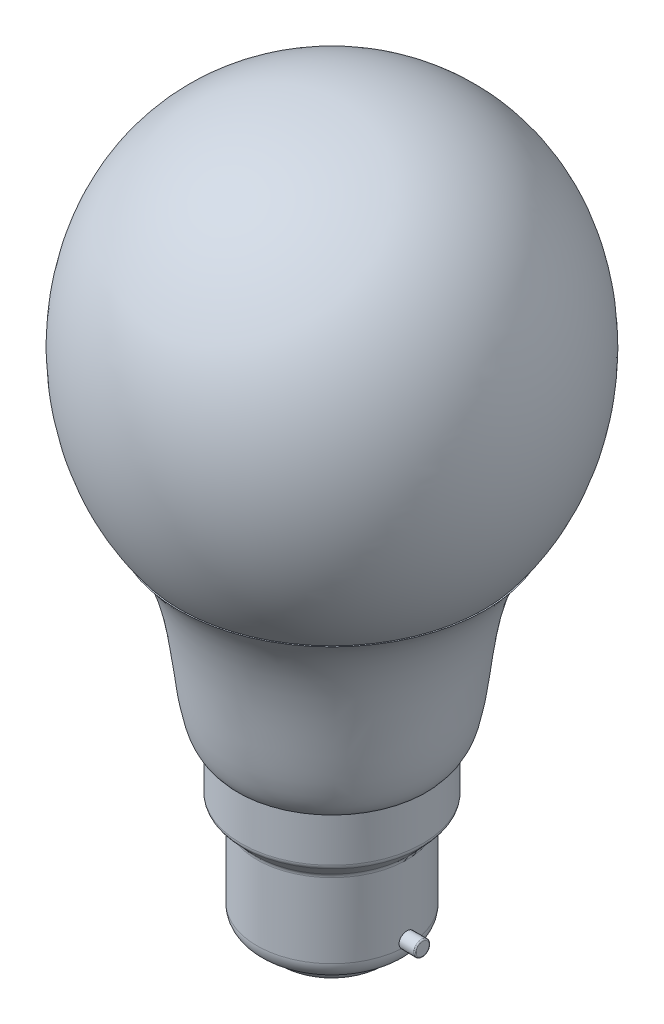
ISO-10303-21;
HEADER;
FILE_DESCRIPTION(('STEP AP214'),'2;1');
FILE_NAME('part.step','',(''),(''),'','','');
FILE_SCHEMA(('AUTOMOTIVE_DESIGN { 1 0 10303 214 1 1 1 1 }'));
ENDSEC;
DATA;
#1=APPLICATION_CONTEXT('core data for automotive mechanical design processes');
#2=APPLICATION_PROTOCOL_DEFINITION('international standard','automotive_design',2000,#1);
#3=PRODUCT_CONTEXT('',#1,'mechanical');
#4=PRODUCT('Part','Part','',(#3));
#5=PRODUCT_RELATED_PRODUCT_CATEGORY('part','',(#4));
#6=PRODUCT_DEFINITION_FORMATION('','',#4);
#7=PRODUCT_DEFINITION_CONTEXT('part definition',#1,'design');
#8=PRODUCT_DEFINITION('design','',#6,#7);
#9=PRODUCT_DEFINITION_SHAPE('','',#8);
#10=(LENGTH_UNIT() NAMED_UNIT(*) SI_UNIT(.MILLI.,.METRE.));
#11=(NAMED_UNIT(*) PLANE_ANGLE_UNIT() SI_UNIT($,.RADIAN.));
#12=(NAMED_UNIT(*) SI_UNIT($,.STERADIAN.) SOLID_ANGLE_UNIT());
#13=UNCERTAINTY_MEASURE_WITH_UNIT(LENGTH_MEASURE(1.E-05),#10,'distance_accuracy_value','');
#14=(GEOMETRIC_REPRESENTATION_CONTEXT(3) GLOBAL_UNCERTAINTY_ASSIGNED_CONTEXT((#13)) GLOBAL_UNIT_ASSIGNED_CONTEXT((#10,
#11,#12)) REPRESENTATION_CONTEXT('',''));
#15=CARTESIAN_POINT('',(0.,0.,0.));
#16=DIRECTION('',(0.,0.,1.));
#17=DIRECTION('',(1.,0.,0.));
#18=AXIS2_PLACEMENT_3D('',#15,#16,#17);
#19=CARTESIAN_POINT('',(0.,30.,0.));
#20=DIRECTION('',(0.,-1.,0.));
#21=DIRECTION('',(0.,0.,-1.));
#22=AXIS2_PLACEMENT_3D('',#19,#20,#21);
#23=PLANE('',#22);
#24=CARTESIAN_POINT('',(0.,30.,0.));
#25=DIRECTION('',(0.,-1.,0.));
#26=DIRECTION('',(0.,0.,-1.));
#27=AXIS2_PLACEMENT_3D('',#24,#25,#26);
#28=CIRCLE('',#27,14.5);
#29=CARTESIAN_POINT('',(0.,30.,-14.5));
#30=VERTEX_POINT('',#29);
#31=EDGE_CURVE('E156',#30,#30,#28,.T.);
#32=ORIENTED_EDGE('',*,*,#31,.F.);
#33=EDGE_LOOP('',(#32));
#34=FACE_BOUND('',#33,.T.);
#35=CARTESIAN_POINT('',(0.,30.,0.));
#36=DIRECTION('',(0.,-1.,0.));
#37=DIRECTION('',(0.,0.,-1.));
#38=AXIS2_PLACEMENT_3D('',#35,#36,#37);
#39=CIRCLE('',#38,15.);
#40=CARTESIAN_POINT('',(0.,30.,-15.));
#41=VERTEX_POINT('',#40);
#42=EDGE_CURVE('E193',#41,#41,#39,.T.);
#43=ORIENTED_EDGE('',*,*,#42,.T.);
#44=EDGE_LOOP('',(#43));
#45=FACE_BOUND('',#44,.T.);
#46=ADVANCED_FACE('F33',(#34,#45),#23,.T.);
#47=CARTESIAN_POINT('',(15.,30.,0.));
#48=CARTESIAN_POINT('',(19.4,34.3,0.));
#49=CARTESIAN_POINT('',(16.4,51.5,0.));
#50=CARTESIAN_POINT('',(24.5114891802732,60.,0.));
#51=B_SPLINE_CURVE_WITH_KNOTS('',3,(#47,#48,#49,#50),.UNSPECIFIED.,.F.,.F.,(4,4),(0.,1.),.UNSPECIFIED.);
#52=CARTESIAN_POINT('',(0.,30.,0.));
#53=DIRECTION('',(0.,-1.,0.));
#54=AXIS1_PLACEMENT('',#52,#53);
#55=SURFACE_OF_REVOLUTION('',#51,#54);
#56=CARTESIAN_POINT('',(0.,60.,0.));
#57=DIRECTION('',(0.,-1.,0.));
#58=DIRECTION('',(0.,0.,-1.));
#59=AXIS2_PLACEMENT_3D('',#56,#57,#58);
#60=CIRCLE('',#59,24.5114891802732);
#61=CARTESIAN_POINT('',(0.,60.,-24.5114891802732));
#62=VERTEX_POINT('',#61);
#63=EDGE_CURVE('E187',#62,#62,#60,.T.);
#64=ORIENTED_EDGE('',*,*,#63,.T.);
#65=EDGE_LOOP('',(#64));
#66=FACE_BOUND('',#65,.T.);
#67=ORIENTED_EDGE('',*,*,#42,.F.);
#68=EDGE_LOOP('',(#67));
#69=FACE_BOUND('',#68,.T.);
#70=ADVANCED_FACE('F79',(#66,#69),#55,.F.);
#71=CARTESIAN_POINT('',(0.,60.,0.));
#72=DIRECTION('',(0.,1.,0.));
#73=DIRECTION('',(0.,0.,1.));
#74=AXIS2_PLACEMENT_3D('',#71,#72,#73);
#75=PLANE('',#74);
#76=CARTESIAN_POINT('',(0.,60.,0.));
#77=DIRECTION('',(0.,-1.,0.));
#78=DIRECTION('',(0.,0.,-1.));
#79=AXIS2_PLACEMENT_3D('',#76,#77,#78);
#80=CIRCLE('',#79,24.3);
#81=CARTESIAN_POINT('',(0.,60.,-24.3));
#82=VERTEX_POINT('',#81);
#83=EDGE_CURVE('E136',#82,#82,#80,.F.);
#84=ORIENTED_EDGE('',*,*,#83,.F.);
#85=EDGE_LOOP('',(#84));
#86=FACE_BOUND('',#85,.T.);
#87=ORIENTED_EDGE('',*,*,#63,.F.);
#88=EDGE_LOOP('',(#87));
#89=FACE_BOUND('',#88,.T.);
#90=ADVANCED_FACE('F85',(#86,#89),#75,.T.);
#91=CARTESIAN_POINT('',(24.3,60.,0.));
#92=CARTESIAN_POINT('',(40.,80.,0.));
#93=CARTESIAN_POINT('',(32.9620865456957,118.,0.));
#94=CARTESIAN_POINT('',(0.,118.,0.));
#95=B_SPLINE_CURVE_WITH_KNOTS('',3,(#91,#92,#93,#94),.UNSPECIFIED.,.F.,.F.,(4,4),(0.,1.),.UNSPECIFIED.);
#96=CARTESIAN_POINT('',(0.,60.,0.));
#97=DIRECTION('',(0.,-1.,0.));
#98=AXIS1_PLACEMENT('',#96,#97);
#99=SURFACE_OF_REVOLUTION('',#95,#98);
#100=CARTESIAN_POINT('',(0.,118.,0.));
#101=VERTEX_POINT('',#100);
#102=VERTEX_LOOP('',#101);
#103=FACE_BOUND('',#102,.T.);
#104=ORIENTED_EDGE('',*,*,#83,.T.);
#105=EDGE_LOOP('',(#104));
#106=FACE_BOUND('',#105,.T.);
#107=ADVANCED_FACE('F170',(#103,#106),#99,.F.);
#108=CARTESIAN_POINT('',(0.,2.,0.));
#109=DIRECTION('',(0.,-1.,0.));
#110=DIRECTION('',(0.,0.,-1.));
#111=AXIS2_PLACEMENT_3D('',#108,#109,#110);
#112=PLANE('',#111);
#113=CARTESIAN_POINT('',(0.,2.,0.));
#114=DIRECTION('',(0.,-1.,0.));
#115=DIRECTION('',(0.,0.,-1.));
#116=AXIS2_PLACEMENT_3D('',#113,#114,#115);
#117=CIRCLE('',#116,6.49242598201266);
#118=CARTESIAN_POINT('',(0.,2.,-6.49242598201266));
#119=VERTEX_POINT('',#118);
#120=EDGE_CURVE('E178',#119,#119,#117,.T.);
#121=ORIENTED_EDGE('',*,*,#120,.T.);
#122=EDGE_LOOP('',(#121));
#123=FACE_BOUND('',#122,.T.);
#124=ADVANCED_FACE('F166',(#123),#112,.T.);
#125=CARTESIAN_POINT('',(0.,4.51694075123591,0.));
#126=DIRECTION('',(0.,-1.,0.));
#127=DIRECTION('',(0.,0.,-1.));
#128=AXIS2_PLACEMENT_3D('',#125,#126,#127);
#129=TOROIDAL_SURFACE('',#128,6.49242598201266,2.51694075123591);
#130=CARTESIAN_POINT('',(0.,4.3,0.));
#131=DIRECTION('',(0.,-1.,0.));
#132=DIRECTION('',(0.,0.,-1.));
#133=AXIS2_PLACEMENT_3D('',#130,#131,#132);
#134=CIRCLE('',#133,9.);
#135=CARTESIAN_POINT('',(0.,4.3,-9.));
#136=VERTEX_POINT('',#135);
#137=EDGE_CURVE('E298',#136,#136,#134,.T.);
#138=ORIENTED_EDGE('',*,*,#137,.T.);
#139=EDGE_LOOP('',(#138));
#140=FACE_BOUND('',#139,.T.);
#141=ORIENTED_EDGE('',*,*,#120,.F.);
#142=EDGE_LOOP('',(#141));
#143=FACE_BOUND('',#142,.T.);
#144=ADVANCED_FACE('F162',(#140,#143),#129,.T.);
#145=CARTESIAN_POINT('',(0.,7.3,0.));
#146=DIRECTION('',(0.,-1.,0.));
#147=DIRECTION('',(0.,0.,-1.));
#148=AXIS2_PLACEMENT_3D('',#145,#146,#147);
#149=TOROIDAL_SURFACE('',#148,9.,3.);
#150=CARTESIAN_POINT('',(11.9689033795343,7.3002,0.863337553551168));
#151=CARTESIAN_POINT('',(11.9706341575066,7.27607125218969,0.839365159570842));
#152=CARTESIAN_POINT('',(11.9720735902,7.25295200182946,0.814380650331551));
#153=CARTESIAN_POINT('',(11.9744692386034,7.20888051311498,0.762552432061032));
#154=CARTESIAN_POINT('',(11.9754255196976,7.18792798184726,0.735708975157763));
#155=CARTESIAN_POINT('',(11.9777164082379,7.1286096995019,0.65273474999263));
#156=CARTESIAN_POINT('',(11.9784789890905,7.09368871092575,0.594066023966319));
#157=CARTESIAN_POINT('',(11.9792180369641,7.03414364574626,0.471741360034935));
#158=CARTESIAN_POINT('',(11.9791943714852,7.00952130539983,0.408084583336799));
#159=CARTESIAN_POINT('',(11.9789561699297,6.97123680559395,0.27755436466876));
#160=CARTESIAN_POINT('',(11.9787416491964,6.95757376526647,0.210681181679771));
#161=CARTESIAN_POINT('',(11.97847561374,6.94154133729614,0.075187146385878));
#162=CARTESIAN_POINT('',(11.978425087023,6.93924035893504,0.00655820268459246));
#163=CARTESIAN_POINT('',(11.9785524448508,6.94618160624795,-0.130128550708673));
#164=CARTESIAN_POINT('',(11.9787303755318,6.95542616349561,-0.198186242244085));
#165=CARTESIAN_POINT('',(11.9790676505371,6.98521598791006,-0.331852418085821));
#166=CARTESIAN_POINT('',(11.9792269749238,7.00577324489496,-0.397458224830683));
#167=CARTESIAN_POINT('',(11.9790057883068,7.05762116610196,-0.524261020037802));
#168=CARTESIAN_POINT('',(11.9786256078853,7.08890524854254,-0.585460684231456));
#169=CARTESIAN_POINT('',(11.976928580572,7.14992301828015,-0.683453304115163));
#170=CARTESIAN_POINT('',(11.9759424700414,7.17707228876608,-0.7218861704971));
#171=CARTESIAN_POINT('',(11.9731223829882,7.23557556513093,-0.795303232034518));
#172=CARTESIAN_POINT('',(11.9712893139324,7.26692504526631,-0.830291069786458));
#173=CARTESIAN_POINT('',(11.9689033795343,7.3002,-0.863337553551168));
#174=B_SPLINE_CURVE_WITH_KNOTS('',3,(#150,#151,#152,#153,#154,#155,#156,#157,#158,#159,#160,
#161,#162,#163,#164,#165,#166,#167,#168,#169,#170,#171,#172,#173),.UNSPECIFIED.,.F.,.F.,(4,2,2,
2,2,2,2,2,2,2,2,4),(0.,0.102105118600656,0.204196415765371,0.407983583896708,0.611805094826217,
0.815610221693627,1.02064094520526,1.22571308052813,1.4310029822916,1.63616714671136,
1.77706011405941,1.91780247157556),.UNSPECIFIED.);
#175=CARTESIAN_POINT('',(11.9689177210223,7.3,0.863138799613092));
#176=VERTEX_POINT('',#175);
#177=CARTESIAN_POINT('',(11.9689177210223,7.3,-0.863138799613093));
#178=VERTEX_POINT('',#177);
#179=EDGE_CURVE('E47',#176,#178,#174,.T.);
#180=ORIENTED_EDGE('',*,*,#179,.F.);
#181=CARTESIAN_POINT('',(0.,7.3,0.));
#182=DIRECTION('',(0.,-1.,0.));
#183=DIRECTION('',(0.,0.,-1.));
#184=AXIS2_PLACEMENT_3D('',#181,#182,#183);
#185=CIRCLE('',#184,12.);
#186=EDGE_CURVE('E297',#176,#178,#185,.T.);
#187=ORIENTED_EDGE('',*,*,#186,.T.);
#188=EDGE_LOOP('',(#180,#187));
#189=FACE_BOUND('',#188,.T.);
#190=ORIENTED_EDGE('',*,*,#137,.F.);
#191=EDGE_LOOP('',(#190));
#192=FACE_BOUND('',#191,.T.);
#193=ADVANCED_FACE('F158',(#189,#192),#149,.T.);
#194=CARTESIAN_POINT('',(0.,0.,0.));
#195=DIRECTION('',(0.,-1.,0.));
#196=DIRECTION('',(0.,0.,-1.));
#197=AXIS2_PLACEMENT_3D('',#194,#195,#196);
#198=CYLINDRICAL_SURFACE('',#197,12.);
#199=CARTESIAN_POINT('',(0.,19.2081304405621,0.));
#200=DIRECTION('',(0.,-1.,0.));
#201=DIRECTION('',(0.,0.,-1.));
#202=AXIS2_PLACEMENT_3D('',#199,#200,#201);
#203=CIRCLE('',#202,12.);
#204=CARTESIAN_POINT('',(0.,19.2081304405621,-12.));
#205=VERTEX_POINT('',#204);
#206=EDGE_CURVE('E11',#205,#205,#203,.T.);
#207=ORIENTED_EDGE('',*,*,#206,.T.);
#208=EDGE_LOOP('',(#207));
#209=FACE_BOUND('',#208,.T.);
#210=CARTESIAN_POINT('',(-11.9733551378516,7.69189243579318,-0.799228842624485));
#211=CARTESIAN_POINT('',(-11.9709108230631,7.73666810789764,-0.835848884443715));
#212=CARTESIAN_POINT('',(-11.9685481032181,7.78456413680672,-0.868720530776431));
#213=CARTESIAN_POINT('',(-11.9642533708202,7.88524242608688,-0.925997730739436));
#214=CARTESIAN_POINT('',(-11.962321833415,7.93802998702529,-0.950393961061867));
#215=CARTESIAN_POINT('',(-11.9591107736815,8.04695699090246,-0.98998281236346));
#216=CARTESIAN_POINT('',(-11.9578310537633,8.10309541230044,-1.0051782227133));
#217=CARTESIAN_POINT('',(-11.9560686173062,8.21712387089126,-1.02593047018923));
#218=CARTESIAN_POINT('',(-11.9555857077967,8.27501348052391,-1.03148964102556));
#219=CARTESIAN_POINT('',(-11.9554710895022,8.39077686496366,-1.03281722486822));
#220=CARTESIAN_POINT('',(-11.9558374943731,8.44865038988828,-1.02860733513095));
#221=CARTESIAN_POINT('',(-11.9573757629071,8.56286852751051,-1.01056693883353));
#222=CARTESIAN_POINT('',(-11.9585476578237,8.61921308079498,-0.996736058973174));
#223=CARTESIAN_POINT('',(-11.9615646154583,8.72879526019824,-0.959849955528018));
#224=CARTESIAN_POINT('',(-11.96340987362,8.78203197905867,-0.936792053611473));
#225=CARTESIAN_POINT('',(-11.9675656879094,8.88388828429431,-0.882111098437407));
#226=CARTESIAN_POINT('',(-11.9698762545422,8.9325077663907,-0.850487851796428));
#227=CARTESIAN_POINT('',(-11.9747128719196,9.02394151515018,-0.779435935863841));
#228=CARTESIAN_POINT('',(-11.9772396880771,9.06673364458091,-0.739978828844984));
#229=CARTESIAN_POINT('',(-11.9822174419855,9.14509656331413,-0.65444364469117));
#230=CARTESIAN_POINT('',(-11.9846683789416,9.18066727698859,-0.608365498224399));
#231=CARTESIAN_POINT('',(-11.9892232157937,9.24363608131418,-0.510795704651895));
#232=CARTESIAN_POINT('',(-11.9913264993498,9.27101972549838,-0.459294702600627));
#233=CARTESIAN_POINT('',(-11.9949434420432,9.31674247139613,-0.352403701698354));
#234=CARTESIAN_POINT('',(-11.9964571117379,9.33508173505446,-0.297013772501093));
#235=CARTESIAN_POINT('',(-11.9987205559673,9.36214534212873,-0.184077412893536));
#236=CARTESIAN_POINT('',(-11.9994724032275,9.37089577962616,-0.126537277903318));
#237=CARTESIAN_POINT('',(-12.0001346430191,9.37861493570346,-0.0108003564379514));
#238=CARTESIAN_POINT('',(-12.0000450530593,9.37758385782017,0.0473964163485029));
#239=CARTESIAN_POINT('',(-11.9990361315213,9.36578873802275,0.162609106576523));
#240=CARTESIAN_POINT('',(-11.9981193047442,9.35505407753285,0.219628057589615));
#241=CARTESIAN_POINT('',(-11.9955621891034,9.32420456302085,0.331051860513969));
#242=CARTESIAN_POINT('',(-11.9939218939766,9.30408962779138,0.385456689789632));
#243=CARTESIAN_POINT('',(-11.9900987328255,9.25502568115005,0.490188549715384));
#244=CARTESIAN_POINT('',(-11.9879151776153,9.2260654377734,0.540510292146107));
#245=CARTESIAN_POINT('',(-11.9832505547734,9.16014182403095,0.63559065249325));
#246=CARTESIAN_POINT('',(-11.9807694798268,9.12317825687357,0.680349133573532));
#247=CARTESIAN_POINT('',(-11.9757777666082,9.04213850459045,0.763203456582288));
#248=CARTESIAN_POINT('',(-11.9732670536227,8.99803693335125,0.801274467833302));
#249=CARTESIAN_POINT('',(-11.9685078247718,8.90405882552769,0.869478558602368));
#250=CARTESIAN_POINT('',(-11.9662593098827,8.8541822674414,0.899611608563779));
#251=CARTESIAN_POINT('',(-11.9622779238526,8.75003459517343,0.951092543112573));
#252=CARTESIAN_POINT('',(-11.9605452985523,8.69576140144957,0.972436241091804));
#253=CARTESIAN_POINT('',(-11.9577945945913,8.58438265356671,1.00569842600469));
#254=CARTESIAN_POINT('',(-11.9567764988745,8.52727716705017,1.01761713791627));
#255=CARTESIAN_POINT('',(-11.9555735907893,8.41206813952015,1.03165424079175));
#256=CARTESIAN_POINT('',(-11.9553858803753,8.3539687811346,1.03380671660731));
#257=CARTESIAN_POINT('',(-11.9558574762483,8.23823586958342,1.02833807617188));
#258=CARTESIAN_POINT('',(-11.9565167700656,8.18060230957282,1.02071710380685));
#259=CARTESIAN_POINT('',(-11.9586050638856,8.06757642532193,0.995950364294392));
#260=CARTESIAN_POINT('',(-11.9600322619454,8.01217917926053,0.978826892507268));
#261=CARTESIAN_POINT('',(-11.9634941277343,7.9050464548704,0.935562066575413));
#262=CARTESIAN_POINT('',(-11.9655288030395,7.85331102221979,0.909420599962458));
#263=CARTESIAN_POINT('',(-11.9699815260405,7.75485275519328,0.84880159181355));
#264=CARTESIAN_POINT('',(-11.9724003423501,7.70814029222029,0.814307263142071));
#265=CARTESIAN_POINT('',(-11.9773468002796,7.62115541959239,0.737985172762881));
#266=CARTESIAN_POINT('',(-11.9798744441977,7.58088314602567,0.696157256127635));
#267=CARTESIAN_POINT('',(-11.9847630505136,7.50779486111379,0.606205881223111));
#268=CARTESIAN_POINT('',(-11.9871234833273,7.47500186837951,0.558063687229684));
#269=CARTESIAN_POINT('',(-11.9914036589495,7.41795737751412,0.456941774893329));
#270=CARTESIAN_POINT('',(-11.9933234026107,7.39370586285729,0.403962065910093));
#271=CARTESIAN_POINT('',(-11.9965055600129,7.35444309966543,0.294684014889312));
#272=CARTESIAN_POINT('',(-11.99776819989,7.33942867194762,0.238386821968091));
#273=CARTESIAN_POINT('',(-11.999494792776,7.31906013051169,0.124061603660808));
#274=CARTESIAN_POINT('',(-11.9999587884693,7.31370550051393,0.0660336709447561));
#275=CARTESIAN_POINT('',(-12.0000358198284,7.31281083038298,-0.0499456798267145));
#276=CARTESIAN_POINT('',(-11.9996510780819,7.31724515594436,-0.107896901026093));
#277=CARTESIAN_POINT('',(-11.9980781419346,7.33575134099819,-0.222242892644024));
#278=CARTESIAN_POINT('',(-11.9968897633901,7.34982540933181,-0.278637303254862));
#279=CARTESIAN_POINT('',(-11.9938425983611,7.38720938213335,-0.388266549394694));
#280=CARTESIAN_POINT('',(-11.9919836508668,7.41052150487664,-0.44150062251919));
#281=CARTESIAN_POINT('',(-11.9878047756708,7.46570650277211,-0.543256721100166));
#282=CARTESIAN_POINT('',(-11.9854853549679,7.49756997601248,-0.591783842385759));
#283=CARTESIAN_POINT('',(-11.981481623089,7.55660792318307,-0.667078800789132));
#284=CARTESIAN_POINT('',(-11.9798540669978,7.58161115724293,-0.695580092952655));
#285=CARTESIAN_POINT('',(-11.9765910592589,7.63459447256391,-0.749666223396765));
#286=CARTESIAN_POINT('',(-11.9749556075846,7.66257456384172,-0.775251051863274));
#287=CARTESIAN_POINT('',(-11.9733551378516,7.69189243579318,-0.799228842624485));
#288=B_SPLINE_CURVE_WITH_KNOTS('',3,(#210,#211,#212,#213,#214,#215,#216,#217,#218,#219,#220,
#221,#222,#223,#224,#225,#226,#227,#228,#229,#230,#231,#232,#233,#234,#235,#236,#237,#238,#239,
#240,#241,#242,#243,#244,#245,#246,#247,#248,#249,#250,#251,#252,#253,#254,#255,#256,#257,#258,
#259,#260,#261,#262,#263,#264,#265,#266,#267,#268,#269,#270,#271,#272,#273,#274,#275,#276,#277,
#278,#279,#280,#281,#282,#283,#284,#285,#286,#287),.UNSPECIFIED.,.T.,.F.,(4,2,2,2,2,2,2,2,2,2,2,
2,2,2,2,2,2,2,2,2,2,2,2,2,2,2,2,2,2,2,2,2,2,2,2,2,2,2,4),(0.,0.173548361190424,
0.347287032696687,0.52097300623491,0.694616910520178,0.867875517865803,1.04114084812466,
1.21445650871124,1.38777608264601,1.56173672349945,1.73569918610398,1.90996682608862,
2.08423134559868,2.25802045209352,2.43180594233813,2.60506698459966,2.77832952685296,
2.95181300285595,3.1253007450819,3.29941962617513,3.47353915558303,3.64774152720637,
3.82193974042862,3.99552951960315,4.16911674319586,4.34229839707861,4.51548221088023,
4.68901701187496,4.86255547936409,5.03662103943651,5.21068626273156,5.38469154340566,
5.55868752388021,5.73222840229671,5.90580905900836,6.07943142182248,6.25286366943766,
6.36649795498896,6.48013262291525),.UNSPECIFIED.);
#289=CARTESIAN_POINT('',(-11.9733551378516,7.69189243579318,-0.799228842624485));
#290=VERTEX_POINT('',#289);
#291=EDGE_CURVE('E137',#290,#290,#288,.T.);
#292=ORIENTED_EDGE('',*,*,#291,.T.);
#293=EDGE_LOOP('',(#292));
#294=FACE_BOUND('',#293,.T.);
#295=ORIENTED_EDGE('',*,*,#186,.F.);
#296=CARTESIAN_POINT('',(11.9689320591518,7.29980000000002,0.862939953536141));
#297=CARTESIAN_POINT('',(11.9671899873021,7.32409729530885,0.887102137699313));
#298=CARTESIAN_POINT('',(11.96544915302,7.34940229179361,0.910227791730076));
#299=CARTESIAN_POINT('',(11.9620173309225,7.40186932200755,0.954268832358208));
#300=CARTESIAN_POINT('',(11.9603263414872,7.42903129529193,0.975184290841334));
#301=CARTESIAN_POINT('',(11.955403615493,7.51298925905739,1.03435660777627));
#302=CARTESIAN_POINT('',(11.9523169834587,7.57232615330209,1.06910775578077));
#303=CARTESIAN_POINT('',(11.9468872794788,7.69602222354421,1.12817138117047));
#304=CARTESIAN_POINT('',(11.9445446198357,7.76038415984394,1.15247807296297));
#305=CARTESIAN_POINT('',(11.940870701843,7.89229401152683,1.18994266412983));
#306=CARTESIAN_POINT('',(11.9395391626414,7.95984103666901,1.20310365948524));
#307=CARTESIAN_POINT('',(11.9380424735856,8.09597648297196,1.21786622816644));
#308=CARTESIAN_POINT('',(11.9378735714068,8.16456083727095,1.21950498901437));
#309=CARTESIAN_POINT('',(11.9387118661998,8.30103883813573,1.21127016348759));
#310=CARTESIAN_POINT('',(11.9397192404089,8.36893237905715,1.20139484221134));
#311=CARTESIAN_POINT('',(11.9427914923095,8.50189536436084,1.17045699104059));
#312=CARTESIAN_POINT('',(11.944853432639,8.56697211135108,1.14942552916439));
#313=CARTESIAN_POINT('',(11.9498001948078,8.69266564268583,1.09679975615236));
#314=CARTESIAN_POINT('',(11.9526849785635,8.75328263327762,1.06520593386181));
#315=CARTESIAN_POINT('',(11.958962454299,8.8685290302671,0.992248082312885));
#316=CARTESIAN_POINT('',(11.9623565433329,8.92314122799889,0.950856992400672));
#317=CARTESIAN_POINT('',(11.9692658506521,9.02465936631418,0.85951578534812));
#318=CARTESIAN_POINT('',(11.9727810742651,9.07156496742457,0.809565291366689));
#319=CARTESIAN_POINT('',(11.9795507638395,9.15649867622926,0.702320786626259));
#320=CARTESIAN_POINT('',(11.9828043110082,9.19449633027548,0.645002592607671));
#321=CARTESIAN_POINT('',(11.9886710734533,9.26032825654952,0.524769989516089));
#322=CARTESIAN_POINT('',(11.9912843001785,9.28816271049821,0.461855680528216));
#323=CARTESIAN_POINT('',(11.9955722224657,9.33282958024878,0.332319479375537));
#324=CARTESIAN_POINT('',(11.9972484416869,9.34967986476322,0.265703801078962));
#325=CARTESIAN_POINT('',(11.9994797948162,9.37195860436306,0.130571284871171));
#326=CARTESIAN_POINT('',(12.0000349583025,9.377387360798,0.0620544971678091));
#327=CARTESIAN_POINT('',(11.9999617462717,9.37666582749276,-0.0746344741611518));
#328=CARTESIAN_POINT('',(11.999338228087,9.37056305906754,-0.142806916278281));
#329=CARTESIAN_POINT('',(11.9969871971385,9.34705052323834,-0.27715270903988));
#330=CARTESIAN_POINT('',(11.9952596865021,9.32964077762156,-0.343326063536096));
#331=CARTESIAN_POINT('',(11.990894122144,9.28402019770727,-0.471796913222667));
#332=CARTESIAN_POINT('',(11.9882561653785,9.25581051349192,-0.534094820287347));
#333=CARTESIAN_POINT('',(11.9823636879452,9.1893931401067,-0.653079913792534));
#334=CARTESIAN_POINT('',(11.9791091467306,9.15118511774053,-0.709766913161811));
#335=CARTESIAN_POINT('',(11.9723317773191,9.06566978589501,-0.816168128474506));
#336=CARTESIAN_POINT('',(11.9688079104104,9.01832604997188,-0.865853004808401));
#337=CARTESIAN_POINT('',(11.9618990646919,8.91596949500049,-0.956580443902911));
#338=CARTESIAN_POINT('',(11.9585140847765,8.86095673701844,-0.997623075472701));
#339=CARTESIAN_POINT('',(11.9522584337095,8.74469569860281,-1.06997398207476));
#340=CARTESIAN_POINT('',(11.9493887158007,8.68343618312682,-1.10126429224197));
#341=CARTESIAN_POINT('',(11.9444974286229,8.55649556849983,-1.15311032749769));
#342=CARTESIAN_POINT('',(11.9424758913137,8.49081430284348,-1.17366564809409));
#343=CARTESIAN_POINT('',(11.9395169895623,8.35712141809536,-1.20339472656674));
#344=CARTESIAN_POINT('',(11.9385761782907,8.28911792402923,-1.21260467580969));
#345=CARTESIAN_POINT('',(11.9378741545265,8.15253483031496,-1.21949719415064));
#346=CARTESIAN_POINT('',(11.9381127400872,8.083955331303,-1.21718173673057));
#347=CARTESIAN_POINT('',(11.939738967679,7.948367340735,-1.20112300697776));
#348=CARTESIAN_POINT('',(11.941123209871,7.8813548033657,-1.18741354687095));
#349=CARTESIAN_POINT('',(11.9448790651669,7.75057521336945,-1.14901436916745));
#350=CARTESIAN_POINT('',(11.9472508989505,7.68680888969279,-1.12432219737388));
#351=CARTESIAN_POINT('',(11.9526680492225,7.56538090363256,-1.06516970343654));
#352=CARTESIAN_POINT('',(11.9557006789007,7.50763104886108,-1.03089033783826));
#353=CARTESIAN_POINT('',(11.9605224441296,7.42584998226894,-0.972769155381693));
#354=CARTESIAN_POINT('',(11.9621762410495,7.39938252364694,-0.952264121661763));
#355=CARTESIAN_POINT('',(11.9655303246656,7.34822275874942,-0.909148918525786));
#356=CARTESIAN_POINT('',(11.9672306134261,7.32353053147402,-0.886538655526925));
#357=CARTESIAN_POINT('',(11.9689320591518,7.29980000000002,-0.862939953536141));
#358=B_SPLINE_CURVE_WITH_KNOTS('',3,(#296,#297,#298,#299,#300,#301,#302,#303,#304,#305,#306,
#307,#308,#309,#310,#311,#312,#313,#314,#315,#316,#317,#318,#319,#320,#321,#322,#323,#324,#325,
#326,#327,#328,#329,#330,#331,#332,#333,#334,#335,#336,#337,#338,#339,#340,#341,#342,#343,#344,
#345,#346,#347,#348,#349,#350,#351,#352,#353,#354,#355,#356,#357),.UNSPECIFIED.,.F.,.F.,(4,2,2,
2,2,2,2,2,2,2,2,2,2,2,2,2,2,2,2,2,2,2,2,2,2,2,2,2,2,2,4),(0.,0.102868170684906,
0.205732994591843,0.411174868236082,0.616730397917196,0.822228810937933,1.0270636808528,
1.23192941855719,1.43622761114123,1.64051634974134,1.84537606976722,2.05024481137969,
2.25580404517423,2.46135960333197,2.66657992990484,2.87179484180587,3.07616590875349,
3.28053658190362,3.48488549773416,3.68924122439411,3.89442926618262,4.09961567421111,
4.30517785453347,4.51074777983588,4.71566023125642,4.92053759696422,5.12480914153291,
5.3291263555738,5.52982092589811,5.63028855310641,5.73076064849126),.UNSPECIFIED.);
#359=EDGE_CURVE('E130',#176,#178,#358,.T.);
#360=ORIENTED_EDGE('',*,*,#359,.T.);
#361=EDGE_LOOP('',(#295,#360));
#362=FACE_BOUND('',#361,.T.);
#363=ADVANCED_FACE('F141',(#209,#294,#362),#198,.T.);
#364=CARTESIAN_POINT('',(0.,22.3,0.));
#365=DIRECTION('',(0.,1.,0.));
#366=DIRECTION('',(0.,0.,1.));
#367=AXIS2_PLACEMENT_3D('',#364,#365,#366);
#368=CONICAL_SURFACE('',#367,14.5,0.74695557337626);
#369=CARTESIAN_POINT('',(0.,22.0124615279396,0.));
#370=DIRECTION('',(0.,-1.,0.));
#371=DIRECTION('',(0.,0.,-1.));
#372=AXIS2_PLACEMENT_3D('',#369,#370,#371);
#373=CIRCLE('',#372,14.2337606740182);
#374=CARTESIAN_POINT('',(0.,22.0124615279396,-14.2337606740182));
#375=VERTEX_POINT('',#374);
#376=EDGE_CURVE('E112',#375,#375,#373,.T.);
#377=ORIENTED_EDGE('',*,*,#376,.T.);
#378=EDGE_LOOP('',(#377));
#379=FACE_BOUND('',#378,.T.);
#380=CARTESIAN_POINT('',(0.,19.8875384720604,0.));
#381=DIRECTION('',(0.,1.,0.));
#382=DIRECTION('',(0.,0.,1.));
#383=AXIS2_PLACEMENT_3D('',#380,#381,#382);
#384=CIRCLE('',#383,12.2662393259818);
#385=CARTESIAN_POINT('',(0.,19.8875384720604,12.2662393259818));
#386=VERTEX_POINT('',#385);
#387=EDGE_CURVE('E114',#386,#386,#384,.T.);
#388=ORIENTED_EDGE('',*,*,#387,.T.);
#389=EDGE_LOOP('',(#388));
#390=FACE_BOUND('',#389,.T.);
#391=ADVANCED_FACE('F74',(#379,#390),#368,.T.);
#392=CARTESIAN_POINT('',(0.,0.,0.));
#393=DIRECTION('',(0.,-1.,0.));
#394=DIRECTION('',(0.,0.,-1.));
#395=AXIS2_PLACEMENT_3D('',#392,#393,#394);
#396=CYLINDRICAL_SURFACE('',#395,14.5);
#397=CARTESIAN_POINT('',(0.,22.6918695594379,0.));
#398=DIRECTION('',(0.,1.,0.));
#399=DIRECTION('',(0.,0.,1.));
#400=AXIS2_PLACEMENT_3D('',#397,#398,#399);
#401=CIRCLE('',#400,14.5);
#402=CARTESIAN_POINT('',(0.,22.6918695594379,14.5));
#403=VERTEX_POINT('',#402);
#404=EDGE_CURVE('E41',#403,#403,#401,.T.);
#405=ORIENTED_EDGE('',*,*,#404,.T.);
#406=EDGE_LOOP('',(#405));
#407=FACE_BOUND('',#406,.T.);
#408=ORIENTED_EDGE('',*,*,#31,.T.);
#409=EDGE_LOOP('',(#408));
#410=FACE_BOUND('',#409,.T.);
#411=ADVANCED_FACE('F63',(#407,#410),#396,.T.);
#412=CARTESIAN_POINT('',(-14.5,8.36459255102353,0.));
#413=DIRECTION('',(-0.999969906217174,0.007758006188178,0.));
#414=DIRECTION('',(-0.007758006188178,-0.999969906217174,0.));
#415=AXIS2_PLACEMENT_3D('',#412,#413,#414);
#416=CONICAL_SURFACE('',#415,0.,1.5630382427832);
#417=CARTESIAN_POINT('',(-14.506302804588,8.36464144969207,0.));
#418=DIRECTION('',(0.999969906217174,-0.007758006188178,0.));
#419=DIRECTION('',(0.007758006188178,0.999969906217174,0.));
#420=AXIS2_PLACEMENT_3D('',#417,#418,#419);
#421=CIRCLE('',#420,0.812425826313814);
#422=CARTESIAN_POINT('',(-14.5,9.17704282703951,0.));
#423=VERTEX_POINT('',#422);
#424=EDGE_CURVE('E122',#423,#423,#421,.F.);
#425=ORIENTED_EDGE('',*,*,#424,.T.);
#426=EDGE_LOOP('',(#425));
#427=FACE_BOUND('',#426,.T.);
#428=CARTESIAN_POINT('',(-14.5,8.36459255102353,0.));
#429=VERTEX_POINT('',#428);
#430=VERTEX_LOOP('',#429);
#431=FACE_BOUND('',#430,.T.);
#432=ADVANCED_FACE('F60',(#427,#431),#416,.F.);
#433=CARTESIAN_POINT('',(-14.5078543591321,8.36465348702407,0.));
#434=DIRECTION('',(0.999969906217174,-0.007758006188178,0.));
#435=DIRECTION('',(0.007758006188178,0.999969906217174,0.));
#436=AXIS2_PLACEMENT_3D('',#433,#434,#435);
#437=CONICAL_SURFACE('',#436,1.01241980755725,0.00775808401169929);
#438=CARTESIAN_POINT('',(-14.3078663964641,8.36310193247999,0.));
#439=DIRECTION('',(-0.999969906217174,0.007758006188178,0.));
#440=DIRECTION('',(-0.007758006188178,-0.999969906217174,0.));
#441=AXIS2_PLACEMENT_3D('',#438,#439,#440);
#442=CIRCLE('',#441,1.01397140879489);
#443=CARTESIAN_POINT('',(-14.3157327929281,7.34916103792047,0.));
#444=VERTEX_POINT('',#443);
#445=EDGE_CURVE('E117',#444,#444,#442,.F.);
#446=ORIENTED_EDGE('',*,*,#445,.T.);
#447=EDGE_LOOP('',(#446));
#448=FACE_BOUND('',#447,.T.);
#449=ORIENTED_EDGE('',*,*,#291,.F.);
#450=EDGE_LOOP('',(#449));
#451=FACE_BOUND('',#450,.T.);
#452=ADVANCED_FACE('F62',(#448,#451),#437,.T.);
#453=CARTESIAN_POINT('',(14.4904002277275,8.13967807813176,0.));
#454=DIRECTION('',(-0.999969906217174,0.007758006188178,0.));
#455=DIRECTION('',(-0.007758006188178,-0.999969906217174,0.));
#456=AXIS2_PLACEMENT_3D('',#453,#454,#455);
#457=CONICAL_SURFACE('',#456,1.23740198701441,1.5630382427832);
#458=CARTESIAN_POINT('',(14.4919517822716,8.13966604079976,0.));
#459=DIRECTION('',(0.999969906217174,-0.007758006188178,0.));
#460=DIRECTION('',(0.007758006188178,0.999969906217174,0.));
#461=AXIS2_PLACEMENT_3D('',#458,#459,#460);
#462=CIRCLE('',#461,1.03740800577098);
#463=CARTESIAN_POINT('',(14.5,9.17704282703951,0.));
#464=VERTEX_POINT('',#463);
#465=EDGE_CURVE('E124',#464,#464,#462,.T.);
#466=ORIENTED_EDGE('',*,*,#465,.T.);
#467=EDGE_LOOP('',(#466));
#468=FACE_BOUND('',#467,.T.);
#469=CARTESIAN_POINT('',(14.5,8.13960360079776,0.));
#470=VERTEX_POINT('',#469);
#471=VERTEX_LOOP('',#470);
#472=FACE_BOUND('',#471,.T.);
#473=ADVANCED_FACE('F70',(#468,#472),#457,.T.);
#474=CARTESIAN_POINT('',(14.2904122650594,8.14122963267584,0.));
#475=DIRECTION('',(-0.999969906217174,0.007758006188178,0.));
#476=DIRECTION('',(-0.007758006188178,-0.999969906217174,0.));
#477=AXIS2_PLACEMENT_3D('',#474,#475,#476);
#478=CIRCLE('',#477,1.23585038577678);
#479=CARTESIAN_POINT('',(14.2808245301189,6.90541643831218,0.));
#480=VERTEX_POINT('',#479);
#481=EDGE_CURVE('E127',#480,#480,#478,.T.);
#482=ORIENTED_EDGE('',*,*,#481,.T.);
#483=EDGE_LOOP('',(#482));
#484=FACE_BOUND('',#483,.T.);
#485=ORIENTED_EDGE('',*,*,#359,.F.);
#486=ORIENTED_EDGE('',*,*,#179,.T.);
#487=EDGE_LOOP('',(#485,#486));
#488=FACE_BOUND('',#487,.T.);
#489=ADVANCED_FACE('F73',(#484,#488),#437,.T.);
#490=CARTESIAN_POINT('',(14.2919638196036,8.14121759534384,0.));
#491=DIRECTION('',(0.999969906217174,-0.007758006188178,0.));
#492=DIRECTION('',(0.007758006188178,0.999969906217174,0.));
#493=AXIS2_PLACEMENT_3D('',#490,#491,#492);
#494=TOROIDAL_SURFACE('',#493,1.03585640453334,0.2);
#495=ORIENTED_EDGE('',*,*,#465,.F.);
#496=EDGE_LOOP('',(#495));
#497=FACE_BOUND('',#496,.T.);
#498=ORIENTED_EDGE('',*,*,#481,.F.);
#499=EDGE_LOOP('',(#498));
#500=FACE_BOUND('',#499,.T.);
#501=ADVANCED_FACE('F93',(#497,#500),#494,.T.);
#502=CARTESIAN_POINT('',(-14.30631484192,8.36308989514799,0.));
#503=DIRECTION('',(0.999969906217174,-0.007758006188178,0.));
#504=DIRECTION('',(0.007758006188178,0.999969906217174,0.));
#505=AXIS2_PLACEMENT_3D('',#502,#503,#504);
#506=TOROIDAL_SURFACE('',#505,0.81397742755145,0.2);
#507=ORIENTED_EDGE('',*,*,#445,.F.);
#508=EDGE_LOOP('',(#507));
#509=FACE_BOUND('',#508,.T.);
#510=ORIENTED_EDGE('',*,*,#424,.F.);
#511=EDGE_LOOP('',(#510));
#512=FACE_BOUND('',#511,.T.);
#513=ADVANCED_FACE('F96',(#509,#512),#506,.T.);
#514=CARTESIAN_POINT('',(0.,22.6918695594379,0.));
#515=DIRECTION('',(0.,1.,0.));
#516=DIRECTION('',(0.,0.,1.));
#517=AXIS2_PLACEMENT_3D('',#514,#515,#516);
#518=TOROIDAL_SURFACE('',#517,13.5,1.);
#519=ORIENTED_EDGE('',*,*,#404,.F.);
#520=EDGE_LOOP('',(#519));
#521=FACE_BOUND('',#520,.T.);
#522=ORIENTED_EDGE('',*,*,#376,.F.);
#523=EDGE_LOOP('',(#522));
#524=FACE_BOUND('',#523,.T.);
#525=ADVANCED_FACE('F99',(#521,#524),#518,.T.);
#526=CARTESIAN_POINT('',(0.,19.2081304405621,0.));
#527=DIRECTION('',(0.,-1.,0.));
#528=DIRECTION('',(0.,0.,-1.));
#529=AXIS2_PLACEMENT_3D('',#526,#527,#528);
#530=TOROIDAL_SURFACE('',#529,13.,1.);
#531=ORIENTED_EDGE('',*,*,#387,.F.);
#532=EDGE_LOOP('',(#531));
#533=FACE_BOUND('',#532,.T.);
#534=ORIENTED_EDGE('',*,*,#206,.F.);
#535=EDGE_LOOP('',(#534));
#536=FACE_BOUND('',#535,.T.);
#537=ADVANCED_FACE('F35',(#533,#536),#530,.F.);
#538=CLOSED_SHELL('',(#46,#70,#90,#107,#124,#144,#193,#363,#391,#411,#432,#452,#473,#489,#501,
#513,#525,#537));
#539=MANIFOLD_SOLID_BREP('B2',#538);
#540=ADVANCED_BREP_SHAPE_REPRESENTATION('',(#18,#539),#14);
#541=SHAPE_DEFINITION_REPRESENTATION(#9,#540);
ENDSEC;
END-ISO-10303-21;
